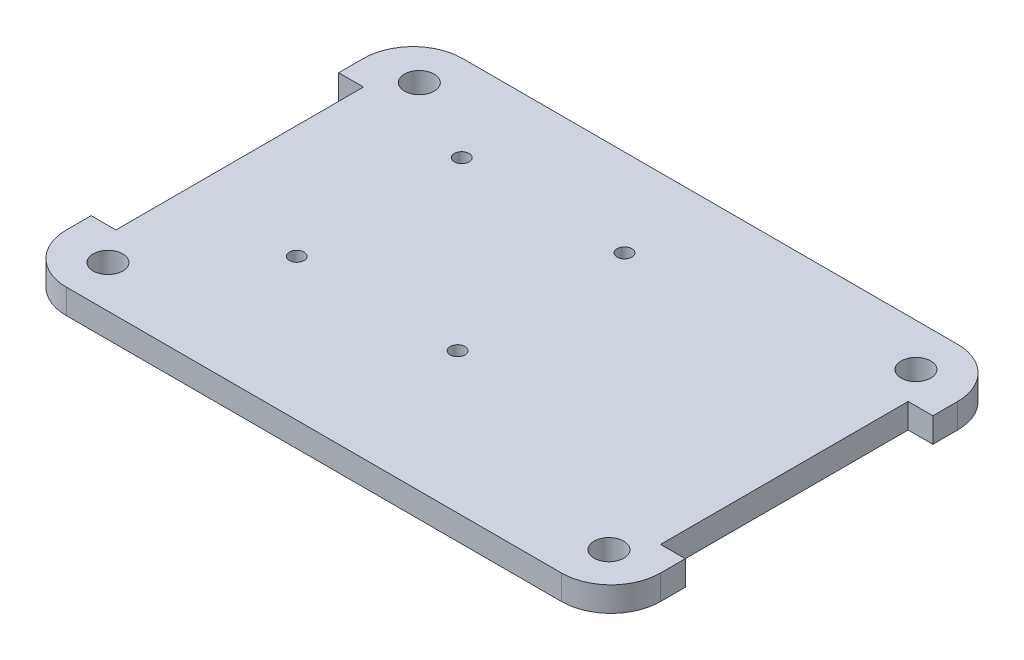
ISO-10303-21;
HEADER;
FILE_DESCRIPTION(('STEP AP214'),'2;1');
FILE_NAME('part.step','',(''),(''),'','','');
FILE_SCHEMA(('AUTOMOTIVE_DESIGN { 1 0 10303 214 1 1 1 1 }'));
ENDSEC;
DATA;
#1=APPLICATION_CONTEXT('core data for automotive mechanical design processes');
#2=APPLICATION_PROTOCOL_DEFINITION('international standard','automotive_design',2000,#1);
#3=PRODUCT_CONTEXT('',#1,'mechanical');
#4=PRODUCT('Part','Part','',(#3));
#5=PRODUCT_RELATED_PRODUCT_CATEGORY('part','',(#4));
#6=PRODUCT_DEFINITION_FORMATION('','',#4);
#7=PRODUCT_DEFINITION_CONTEXT('part definition',#1,'design');
#8=PRODUCT_DEFINITION('design','',#6,#7);
#9=PRODUCT_DEFINITION_SHAPE('','',#8);
#10=(LENGTH_UNIT() NAMED_UNIT(*) SI_UNIT(.MILLI.,.METRE.));
#11=(NAMED_UNIT(*) PLANE_ANGLE_UNIT() SI_UNIT($,.RADIAN.));
#12=(NAMED_UNIT(*) SI_UNIT($,.STERADIAN.) SOLID_ANGLE_UNIT());
#13=UNCERTAINTY_MEASURE_WITH_UNIT(LENGTH_MEASURE(1.E-05),#10,'distance_accuracy_value','');
#14=(GEOMETRIC_REPRESENTATION_CONTEXT(3) GLOBAL_UNCERTAINTY_ASSIGNED_CONTEXT((#13)) GLOBAL_UNIT_ASSIGNED_CONTEXT((#10,
#11,#12)) REPRESENTATION_CONTEXT('',''));
#15=CARTESIAN_POINT('',(0.,0.,0.));
#16=DIRECTION('',(0.,0.,1.));
#17=DIRECTION('',(1.,0.,0.));
#18=AXIS2_PLACEMENT_3D('',#15,#16,#17);
#19=CARTESIAN_POINT('',(115.,5.,15.));
#20=DIRECTION('',(1.,0.,0.));
#21=DIRECTION('',(0.,0.,-1.));
#22=AXIS2_PLACEMENT_3D('',#19,#20,#21);
#23=PLANE('',#22);
#24=DIRECTION('',(0.,0.,1.));
#25=VECTOR('',#24,1.);
#26=CARTESIAN_POINT('',(115.,0.,15.));
#27=LINE('',#26,#25);
#28=CARTESIAN_POINT('',(115.,0.,15.));
#29=VERTEX_POINT('',#28);
#30=CARTESIAN_POINT('',(115.,0.,65.));
#31=VERTEX_POINT('',#30);
#32=EDGE_CURVE('E246',#29,#31,#27,.T.);
#33=ORIENTED_EDGE('',*,*,#32,.F.);
#34=DIRECTION('',(0.,-1.,0.));
#35=VECTOR('',#34,1.);
#36=CARTESIAN_POINT('',(115.,5.,15.));
#37=LINE('',#36,#35);
#38=CARTESIAN_POINT('',(115.,5.,15.));
#39=VERTEX_POINT('',#38);
#40=EDGE_CURVE('E12',#39,#29,#37,.T.);
#41=ORIENTED_EDGE('',*,*,#40,.F.);
#42=DIRECTION('',(0.,0.,1.));
#43=VECTOR('',#42,1.);
#44=CARTESIAN_POINT('',(115.,5.,15.));
#45=LINE('',#44,#43);
#46=CARTESIAN_POINT('',(115.,5.,65.));
#47=VERTEX_POINT('',#46);
#48=EDGE_CURVE('E234',#39,#47,#45,.T.);
#49=ORIENTED_EDGE('',*,*,#48,.T.);
#50=DIRECTION('',(0.,-1.,0.));
#51=VECTOR('',#50,1.);
#52=CARTESIAN_POINT('',(115.,5.,65.));
#53=LINE('',#52,#51);
#54=EDGE_CURVE('E44',#47,#31,#53,.T.);
#55=ORIENTED_EDGE('',*,*,#54,.T.);
#56=EDGE_LOOP('',(#33,#41,#49,#55));
#57=FACE_BOUND('',#56,.T.);
#58=ADVANCED_FACE('F41',(#57),#23,.T.);
#59=CARTESIAN_POINT('',(120.,5.,15.));
#60=DIRECTION('',(0.,0.,1.));
#61=DIRECTION('',(1.,0.,0.));
#62=AXIS2_PLACEMENT_3D('',#59,#60,#61);
#63=PLANE('',#62);
#64=DIRECTION('',(-1.,0.,0.));
#65=VECTOR('',#64,1.);
#66=CARTESIAN_POINT('',(120.,0.,15.));
#67=LINE('',#66,#65);
#68=CARTESIAN_POINT('',(120.,0.,15.));
#69=VERTEX_POINT('',#68);
#70=EDGE_CURVE('E237',#69,#29,#67,.T.);
#71=ORIENTED_EDGE('',*,*,#70,.F.);
#72=DIRECTION('',(0.,-1.,0.));
#73=VECTOR('',#72,1.);
#74=CARTESIAN_POINT('',(120.,5.,15.));
#75=LINE('',#74,#73);
#76=CARTESIAN_POINT('',(120.,5.,15.));
#77=VERTEX_POINT('',#76);
#78=EDGE_CURVE('E50',#77,#69,#75,.T.);
#79=ORIENTED_EDGE('',*,*,#78,.F.);
#80=DIRECTION('',(-1.,0.,0.));
#81=VECTOR('',#80,1.);
#82=CARTESIAN_POINT('',(120.,5.,15.));
#83=LINE('',#82,#81);
#84=EDGE_CURVE('E176',#77,#39,#83,.T.);
#85=ORIENTED_EDGE('',*,*,#84,.T.);
#86=ORIENTED_EDGE('',*,*,#40,.T.);
#87=EDGE_LOOP('',(#71,#79,#85,#86));
#88=FACE_BOUND('',#87,.T.);
#89=ADVANCED_FACE('F318',(#88),#63,.T.);
#90=CARTESIAN_POINT('',(120.,5.,10.0000000000001));
#91=DIRECTION('',(1.,0.,0.));
#92=DIRECTION('',(0.,0.,-1.));
#93=AXIS2_PLACEMENT_3D('',#90,#91,#92);
#94=PLANE('',#93);
#95=DIRECTION('',(0.,0.,1.));
#96=VECTOR('',#95,1.);
#97=CARTESIAN_POINT('',(120.,0.,10.0000000000001));
#98=LINE('',#97,#96);
#99=CARTESIAN_POINT('',(120.,0.,10.0000000000001));
#100=VERTEX_POINT('',#99);
#101=EDGE_CURVE('E163',#100,#69,#98,.T.);
#102=ORIENTED_EDGE('',*,*,#101,.F.);
#103=DIRECTION('',(0.,-1.,0.));
#104=VECTOR('',#103,1.);
#105=CARTESIAN_POINT('',(120.,5.,10.0000000000001));
#106=LINE('',#105,#104);
#107=CARTESIAN_POINT('',(120.,5.,10.0000000000001));
#108=VERTEX_POINT('',#107);
#109=EDGE_CURVE('E158',#108,#100,#106,.T.);
#110=ORIENTED_EDGE('',*,*,#109,.F.);
#111=DIRECTION('',(0.,0.,1.));
#112=VECTOR('',#111,1.);
#113=CARTESIAN_POINT('',(120.,5.,10.0000000000001));
#114=LINE('',#113,#112);
#115=EDGE_CURVE('E161',#108,#77,#114,.T.);
#116=ORIENTED_EDGE('',*,*,#115,.T.);
#117=ORIENTED_EDGE('',*,*,#78,.T.);
#118=EDGE_LOOP('',(#102,#110,#116,#117));
#119=FACE_BOUND('',#118,.T.);
#120=ADVANCED_FACE('F160',(#119),#94,.T.);
#121=CARTESIAN_POINT('',(110.,5.,10.));
#122=DIRECTION('',(0.,-1.,0.));
#123=DIRECTION('',(0.,0.,-1.));
#124=AXIS2_PLACEMENT_3D('',#121,#122,#123);
#125=CYLINDRICAL_SURFACE('',#124,10.);
#126=CARTESIAN_POINT('',(110.,0.,10.));
#127=DIRECTION('',(0.,-1.,0.));
#128=DIRECTION('',(0.,0.,-1.));
#129=AXIS2_PLACEMENT_3D('',#126,#127,#128);
#130=CIRCLE('',#129,10.);
#131=CARTESIAN_POINT('',(110.,0.,0.));
#132=VERTEX_POINT('',#131);
#133=EDGE_CURVE('E281',#132,#100,#130,.T.);
#134=ORIENTED_EDGE('',*,*,#133,.F.);
#135=DIRECTION('',(0.,-1.,0.));
#136=VECTOR('',#135,1.);
#137=CARTESIAN_POINT('',(110.,5.,0.));
#138=LINE('',#137,#136);
#139=CARTESIAN_POINT('',(110.,5.,0.));
#140=VERTEX_POINT('',#139);
#141=EDGE_CURVE('E168',#140,#132,#138,.T.);
#142=ORIENTED_EDGE('',*,*,#141,.F.);
#143=CARTESIAN_POINT('',(110.,5.,10.));
#144=DIRECTION('',(0.,-1.,0.));
#145=DIRECTION('',(0.,0.,-1.));
#146=AXIS2_PLACEMENT_3D('',#143,#144,#145);
#147=CIRCLE('',#146,10.);
#148=EDGE_CURVE('E174',#140,#108,#147,.T.);
#149=ORIENTED_EDGE('',*,*,#148,.T.);
#150=ORIENTED_EDGE('',*,*,#109,.T.);
#151=EDGE_LOOP('',(#134,#142,#149,#150));
#152=FACE_BOUND('',#151,.T.);
#153=ADVANCED_FACE('F178',(#152),#125,.T.);
#154=CARTESIAN_POINT('',(10.0000000000001,5.,0.));
#155=DIRECTION('',(0.,0.,-1.));
#156=DIRECTION('',(-1.,0.,0.));
#157=AXIS2_PLACEMENT_3D('',#154,#155,#156);
#158=PLANE('',#157);
#159=DIRECTION('',(1.,0.,0.));
#160=VECTOR('',#159,1.);
#161=CARTESIAN_POINT('',(10.0000000000001,0.,0.));
#162=LINE('',#161,#160);
#163=CARTESIAN_POINT('',(10.0000000000001,0.,0.));
#164=VERTEX_POINT('',#163);
#165=EDGE_CURVE('E278',#164,#132,#162,.T.);
#166=ORIENTED_EDGE('',*,*,#165,.F.);
#167=DIRECTION('',(0.,-1.,0.));
#168=VECTOR('',#167,1.);
#169=CARTESIAN_POINT('',(10.0000000000001,5.,0.));
#170=LINE('',#169,#168);
#171=CARTESIAN_POINT('',(10.0000000000001,5.,0.));
#172=VERTEX_POINT('',#171);
#173=EDGE_CURVE('E288',#172,#164,#170,.T.);
#174=ORIENTED_EDGE('',*,*,#173,.F.);
#175=DIRECTION('',(1.,0.,0.));
#176=VECTOR('',#175,1.);
#177=CARTESIAN_POINT('',(10.0000000000001,5.,0.));
#178=LINE('',#177,#176);
#179=EDGE_CURVE('E179',#172,#140,#178,.T.);
#180=ORIENTED_EDGE('',*,*,#179,.T.);
#181=ORIENTED_EDGE('',*,*,#141,.T.);
#182=EDGE_LOOP('',(#166,#174,#180,#181));
#183=FACE_BOUND('',#182,.T.);
#184=ADVANCED_FACE('F331',(#183),#158,.T.);
#185=CARTESIAN_POINT('',(10.,5.,10.));
#186=DIRECTION('',(0.,-1.,0.));
#187=DIRECTION('',(0.,0.,-1.));
#188=AXIS2_PLACEMENT_3D('',#185,#186,#187);
#189=CYLINDRICAL_SURFACE('',#188,10.);
#190=CARTESIAN_POINT('',(10.,0.,10.));
#191=DIRECTION('',(0.,1.,0.));
#192=DIRECTION('',(0.,0.,1.));
#193=AXIS2_PLACEMENT_3D('',#190,#191,#192);
#194=CIRCLE('',#193,10.);
#195=CARTESIAN_POINT('',(0.,0.,10.0000000000001));
#196=VERTEX_POINT('',#195);
#197=EDGE_CURVE('E276',#164,#196,#194,.T.);
#198=ORIENTED_EDGE('',*,*,#197,.T.);
#199=DIRECTION('',(0.,-1.,0.));
#200=VECTOR('',#199,1.);
#201=CARTESIAN_POINT('',(0.,5.,10.0000000000001));
#202=LINE('',#201,#200);
#203=CARTESIAN_POINT('',(0.,5.,10.0000000000001));
#204=VERTEX_POINT('',#203);
#205=EDGE_CURVE('E290',#204,#196,#202,.T.);
#206=ORIENTED_EDGE('',*,*,#205,.F.);
#207=CARTESIAN_POINT('',(10.,5.,10.));
#208=DIRECTION('',(0.,1.,0.));
#209=DIRECTION('',(0.,0.,1.));
#210=AXIS2_PLACEMENT_3D('',#207,#208,#209);
#211=CIRCLE('',#210,10.);
#212=EDGE_CURVE('E181',#172,#204,#211,.T.);
#213=ORIENTED_EDGE('',*,*,#212,.F.);
#214=ORIENTED_EDGE('',*,*,#173,.T.);
#215=EDGE_LOOP('',(#198,#206,#213,#214));
#216=FACE_BOUND('',#215,.T.);
#217=ADVANCED_FACE('F334',(#216),#189,.T.);
#218=CARTESIAN_POINT('',(0.,5.,10.0000000000001));
#219=DIRECTION('',(1.,0.,0.));
#220=DIRECTION('',(0.,0.,-1.));
#221=AXIS2_PLACEMENT_3D('',#218,#219,#220);
#222=PLANE('',#221);
#223=DIRECTION('',(0.,0.,1.));
#224=VECTOR('',#223,1.);
#225=CARTESIAN_POINT('',(0.,0.,10.0000000000001));
#226=LINE('',#225,#224);
#227=CARTESIAN_POINT('',(0.,0.,15.));
#228=VERTEX_POINT('',#227);
#229=EDGE_CURVE('E274',#196,#228,#226,.T.);
#230=ORIENTED_EDGE('',*,*,#229,.T.);
#231=DIRECTION('',(0.,-1.,0.));
#232=VECTOR('',#231,1.);
#233=CARTESIAN_POINT('',(0.,5.,15.));
#234=LINE('',#233,#232);
#235=CARTESIAN_POINT('',(0.,5.,15.));
#236=VERTEX_POINT('',#235);
#237=EDGE_CURVE('E293',#236,#228,#234,.T.);
#238=ORIENTED_EDGE('',*,*,#237,.F.);
#239=DIRECTION('',(0.,0.,1.));
#240=VECTOR('',#239,1.);
#241=CARTESIAN_POINT('',(0.,5.,10.0000000000001));
#242=LINE('',#241,#240);
#243=EDGE_CURVE('E197',#204,#236,#242,.T.);
#244=ORIENTED_EDGE('',*,*,#243,.F.);
#245=ORIENTED_EDGE('',*,*,#205,.T.);
#246=EDGE_LOOP('',(#230,#238,#244,#245));
#247=FACE_BOUND('',#246,.T.);
#248=ADVANCED_FACE('F338',(#247),#222,.F.);
#249=CARTESIAN_POINT('',(0.,5.,15.));
#250=DIRECTION('',(0.,0.,-1.));
#251=DIRECTION('',(-1.,0.,0.));
#252=AXIS2_PLACEMENT_3D('',#249,#250,#251);
#253=PLANE('',#252);
#254=DIRECTION('',(1.,0.,0.));
#255=VECTOR('',#254,1.);
#256=CARTESIAN_POINT('',(0.,0.,15.));
#257=LINE('',#256,#255);
#258=CARTESIAN_POINT('',(5.,0.,15.));
#259=VERTEX_POINT('',#258);
#260=EDGE_CURVE('E272',#228,#259,#257,.T.);
#261=ORIENTED_EDGE('',*,*,#260,.T.);
#262=DIRECTION('',(0.,-1.,0.));
#263=VECTOR('',#262,1.);
#264=CARTESIAN_POINT('',(5.,5.,15.));
#265=LINE('',#264,#263);
#266=CARTESIAN_POINT('',(5.,5.,15.));
#267=VERTEX_POINT('',#266);
#268=EDGE_CURVE('E296',#267,#259,#265,.T.);
#269=ORIENTED_EDGE('',*,*,#268,.F.);
#270=DIRECTION('',(1.,0.,0.));
#271=VECTOR('',#270,1.);
#272=CARTESIAN_POINT('',(0.,5.,15.));
#273=LINE('',#272,#271);
#274=EDGE_CURVE('E200',#236,#267,#273,.T.);
#275=ORIENTED_EDGE('',*,*,#274,.F.);
#276=ORIENTED_EDGE('',*,*,#237,.T.);
#277=EDGE_LOOP('',(#261,#269,#275,#276));
#278=FACE_BOUND('',#277,.T.);
#279=ADVANCED_FACE('F342',(#278),#253,.F.);
#280=CARTESIAN_POINT('',(5.,5.,15.));
#281=DIRECTION('',(1.,0.,0.));
#282=DIRECTION('',(0.,0.,-1.));
#283=AXIS2_PLACEMENT_3D('',#280,#281,#282);
#284=PLANE('',#283);
#285=DIRECTION('',(0.,0.,1.));
#286=VECTOR('',#285,1.);
#287=CARTESIAN_POINT('',(5.,0.,15.));
#288=LINE('',#287,#286);
#289=CARTESIAN_POINT('',(5.,0.,65.));
#290=VERTEX_POINT('',#289);
#291=EDGE_CURVE('E270',#259,#290,#288,.T.);
#292=ORIENTED_EDGE('',*,*,#291,.T.);
#293=DIRECTION('',(0.,-1.,0.));
#294=VECTOR('',#293,1.);
#295=CARTESIAN_POINT('',(5.,5.,65.));
#296=LINE('',#295,#294);
#297=CARTESIAN_POINT('',(5.,5.,65.));
#298=VERTEX_POINT('',#297);
#299=EDGE_CURVE('E299',#298,#290,#296,.T.);
#300=ORIENTED_EDGE('',*,*,#299,.F.);
#301=DIRECTION('',(0.,0.,1.));
#302=VECTOR('',#301,1.);
#303=CARTESIAN_POINT('',(5.,5.,15.));
#304=LINE('',#303,#302);
#305=EDGE_CURVE('E203',#267,#298,#304,.T.);
#306=ORIENTED_EDGE('',*,*,#305,.F.);
#307=ORIENTED_EDGE('',*,*,#268,.T.);
#308=EDGE_LOOP('',(#292,#300,#306,#307));
#309=FACE_BOUND('',#308,.T.);
#310=ADVANCED_FACE('F346',(#309),#284,.F.);
#311=CARTESIAN_POINT('',(5.,5.,65.));
#312=DIRECTION('',(0.,0.,1.));
#313=DIRECTION('',(1.,0.,0.));
#314=AXIS2_PLACEMENT_3D('',#311,#312,#313);
#315=PLANE('',#314);
#316=DIRECTION('',(-1.,0.,0.));
#317=VECTOR('',#316,1.);
#318=CARTESIAN_POINT('',(5.,0.,65.));
#319=LINE('',#318,#317);
#320=CARTESIAN_POINT('',(0.,0.,65.));
#321=VERTEX_POINT('',#320);
#322=EDGE_CURVE('E267',#290,#321,#319,.T.);
#323=ORIENTED_EDGE('',*,*,#322,.T.);
#324=DIRECTION('',(0.,-1.,0.));
#325=VECTOR('',#324,1.);
#326=CARTESIAN_POINT('',(0.,5.,65.));
#327=LINE('',#326,#325);
#328=CARTESIAN_POINT('',(0.,5.,65.));
#329=VERTEX_POINT('',#328);
#330=EDGE_CURVE('E302',#329,#321,#327,.T.);
#331=ORIENTED_EDGE('',*,*,#330,.F.);
#332=DIRECTION('',(-1.,0.,0.));
#333=VECTOR('',#332,1.);
#334=CARTESIAN_POINT('',(5.,5.,65.));
#335=LINE('',#334,#333);
#336=EDGE_CURVE('E211',#298,#329,#335,.T.);
#337=ORIENTED_EDGE('',*,*,#336,.F.);
#338=ORIENTED_EDGE('',*,*,#299,.T.);
#339=EDGE_LOOP('',(#323,#331,#337,#338));
#340=FACE_BOUND('',#339,.T.);
#341=ADVANCED_FACE('F350',(#340),#315,.F.);
#342=CARTESIAN_POINT('',(0.,5.,69.9999999999999));
#343=DIRECTION('',(-1.,0.,0.));
#344=DIRECTION('',(0.,0.,1.));
#345=AXIS2_PLACEMENT_3D('',#342,#343,#344);
#346=PLANE('',#345);
#347=DIRECTION('',(0.,0.,-1.));
#348=VECTOR('',#347,1.);
#349=CARTESIAN_POINT('',(0.,0.,69.9999999999999));
#350=LINE('',#349,#348);
#351=CARTESIAN_POINT('',(0.,0.,69.9999999999999));
#352=VERTEX_POINT('',#351);
#353=EDGE_CURVE('E264',#352,#321,#350,.T.);
#354=ORIENTED_EDGE('',*,*,#353,.F.);
#355=DIRECTION('',(0.,-1.,0.));
#356=VECTOR('',#355,1.);
#357=CARTESIAN_POINT('',(0.,5.,69.9999999999999));
#358=LINE('',#357,#356);
#359=CARTESIAN_POINT('',(0.,5.,69.9999999999999));
#360=VERTEX_POINT('',#359);
#361=EDGE_CURVE('E304',#360,#352,#358,.T.);
#362=ORIENTED_EDGE('',*,*,#361,.F.);
#363=DIRECTION('',(0.,0.,-1.));
#364=VECTOR('',#363,1.);
#365=CARTESIAN_POINT('',(0.,5.,69.9999999999999));
#366=LINE('',#365,#364);
#367=EDGE_CURVE('E213',#360,#329,#366,.T.);
#368=ORIENTED_EDGE('',*,*,#367,.T.);
#369=ORIENTED_EDGE('',*,*,#330,.T.);
#370=EDGE_LOOP('',(#354,#362,#368,#369));
#371=FACE_BOUND('',#370,.T.);
#372=ADVANCED_FACE('F354',(#371),#346,.T.);
#373=CARTESIAN_POINT('',(10.,5.,70.));
#374=DIRECTION('',(0.,-1.,0.));
#375=DIRECTION('',(0.,0.,-1.));
#376=AXIS2_PLACEMENT_3D('',#373,#374,#375);
#377=CYLINDRICAL_SURFACE('',#376,10.);
#378=CARTESIAN_POINT('',(10.,0.,70.));
#379=DIRECTION('',(0.,1.,0.));
#380=DIRECTION('',(0.,0.,1.));
#381=AXIS2_PLACEMENT_3D('',#378,#379,#380);
#382=CIRCLE('',#381,10.);
#383=CARTESIAN_POINT('',(10.0000000000001,0.,80.));
#384=VERTEX_POINT('',#383);
#385=EDGE_CURVE('E262',#352,#384,#382,.T.);
#386=ORIENTED_EDGE('',*,*,#385,.T.);
#387=DIRECTION('',(0.,-1.,0.));
#388=VECTOR('',#387,1.);
#389=CARTESIAN_POINT('',(10.0000000000001,5.,80.));
#390=LINE('',#389,#388);
#391=CARTESIAN_POINT('',(10.0000000000001,5.,80.));
#392=VERTEX_POINT('',#391);
#393=EDGE_CURVE('E306',#392,#384,#390,.T.);
#394=ORIENTED_EDGE('',*,*,#393,.F.);
#395=CARTESIAN_POINT('',(10.,5.,70.));
#396=DIRECTION('',(0.,1.,0.));
#397=DIRECTION('',(0.,0.,1.));
#398=AXIS2_PLACEMENT_3D('',#395,#396,#397);
#399=CIRCLE('',#398,10.);
#400=EDGE_CURVE('E217',#360,#392,#399,.T.);
#401=ORIENTED_EDGE('',*,*,#400,.F.);
#402=ORIENTED_EDGE('',*,*,#361,.T.);
#403=EDGE_LOOP('',(#386,#394,#401,#402));
#404=FACE_BOUND('',#403,.T.);
#405=ADVANCED_FACE('F358',(#404),#377,.T.);
#406=CARTESIAN_POINT('',(10.0000000000001,5.,80.));
#407=DIRECTION('',(0.,0.,-1.));
#408=DIRECTION('',(-1.,0.,0.));
#409=AXIS2_PLACEMENT_3D('',#406,#407,#408);
#410=PLANE('',#409);
#411=DIRECTION('',(1.,0.,0.));
#412=VECTOR('',#411,1.);
#413=CARTESIAN_POINT('',(10.0000000000001,0.,80.));
#414=LINE('',#413,#412);
#415=CARTESIAN_POINT('',(110.,0.,80.));
#416=VERTEX_POINT('',#415);
#417=EDGE_CURVE('E259',#384,#416,#414,.T.);
#418=ORIENTED_EDGE('',*,*,#417,.T.);
#419=DIRECTION('',(0.,-1.,0.));
#420=VECTOR('',#419,1.);
#421=CARTESIAN_POINT('',(110.,5.,80.));
#422=LINE('',#421,#420);
#423=CARTESIAN_POINT('',(110.,5.,80.));
#424=VERTEX_POINT('',#423);
#425=EDGE_CURVE('E309',#424,#416,#422,.T.);
#426=ORIENTED_EDGE('',*,*,#425,.F.);
#427=DIRECTION('',(1.,0.,0.));
#428=VECTOR('',#427,1.);
#429=CARTESIAN_POINT('',(10.0000000000001,5.,80.));
#430=LINE('',#429,#428);
#431=EDGE_CURVE('E220',#392,#424,#430,.T.);
#432=ORIENTED_EDGE('',*,*,#431,.F.);
#433=ORIENTED_EDGE('',*,*,#393,.T.);
#434=EDGE_LOOP('',(#418,#426,#432,#433));
#435=FACE_BOUND('',#434,.T.);
#436=ADVANCED_FACE('F362',(#435),#410,.F.);
#437=CARTESIAN_POINT('',(110.,5.,70.));
#438=DIRECTION('',(0.,-1.,0.));
#439=DIRECTION('',(0.,0.,-1.));
#440=AXIS2_PLACEMENT_3D('',#437,#438,#439);
#441=CYLINDRICAL_SURFACE('',#440,9.99999999999999);
#442=CARTESIAN_POINT('',(110.,0.,70.));
#443=DIRECTION('',(0.,-1.,0.));
#444=DIRECTION('',(0.,0.,-1.));
#445=AXIS2_PLACEMENT_3D('',#442,#443,#444);
#446=CIRCLE('',#445,9.99999999999999);
#447=CARTESIAN_POINT('',(120.,0.,69.9999999999999));
#448=VERTEX_POINT('',#447);
#449=EDGE_CURVE('E256',#448,#416,#446,.T.);
#450=ORIENTED_EDGE('',*,*,#449,.F.);
#451=DIRECTION('',(0.,-1.,0.));
#452=VECTOR('',#451,1.);
#453=CARTESIAN_POINT('',(120.,5.,69.9999999999999));
#454=LINE('',#453,#452);
#455=CARTESIAN_POINT('',(120.,5.,69.9999999999999));
#456=VERTEX_POINT('',#455);
#457=EDGE_CURVE('E311',#456,#448,#454,.T.);
#458=ORIENTED_EDGE('',*,*,#457,.F.);
#459=CARTESIAN_POINT('',(110.,5.,70.));
#460=DIRECTION('',(0.,-1.,0.));
#461=DIRECTION('',(0.,0.,-1.));
#462=AXIS2_PLACEMENT_3D('',#459,#460,#461);
#463=CIRCLE('',#462,9.99999999999999);
#464=EDGE_CURVE('E226',#456,#424,#463,.T.);
#465=ORIENTED_EDGE('',*,*,#464,.T.);
#466=ORIENTED_EDGE('',*,*,#425,.T.);
#467=EDGE_LOOP('',(#450,#458,#465,#466));
#468=FACE_BOUND('',#467,.T.);
#469=ADVANCED_FACE('F366',(#468),#441,.T.);
#470=CARTESIAN_POINT('',(120.,5.,69.9999999999999));
#471=DIRECTION('',(-1.,0.,0.));
#472=DIRECTION('',(0.,0.,1.));
#473=AXIS2_PLACEMENT_3D('',#470,#471,#472);
#474=PLANE('',#473);
#475=DIRECTION('',(0.,0.,-1.));
#476=VECTOR('',#475,1.);
#477=CARTESIAN_POINT('',(120.,0.,69.9999999999999));
#478=LINE('',#477,#476);
#479=CARTESIAN_POINT('',(120.,0.,65.));
#480=VERTEX_POINT('',#479);
#481=EDGE_CURVE('E253',#448,#480,#478,.T.);
#482=ORIENTED_EDGE('',*,*,#481,.T.);
#483=DIRECTION('',(0.,-1.,0.));
#484=VECTOR('',#483,1.);
#485=CARTESIAN_POINT('',(120.,5.,65.));
#486=LINE('',#485,#484);
#487=CARTESIAN_POINT('',(120.,5.,65.));
#488=VERTEX_POINT('',#487);
#489=EDGE_CURVE('E312',#488,#480,#486,.T.);
#490=ORIENTED_EDGE('',*,*,#489,.F.);
#491=DIRECTION('',(0.,0.,-1.));
#492=VECTOR('',#491,1.);
#493=CARTESIAN_POINT('',(120.,5.,69.9999999999999));
#494=LINE('',#493,#492);
#495=EDGE_CURVE('E229',#456,#488,#494,.T.);
#496=ORIENTED_EDGE('',*,*,#495,.F.);
#497=ORIENTED_EDGE('',*,*,#457,.T.);
#498=EDGE_LOOP('',(#482,#490,#496,#497));
#499=FACE_BOUND('',#498,.T.);
#500=ADVANCED_FACE('F370',(#499),#474,.F.);
#501=CARTESIAN_POINT('',(115.,5.,65.));
#502=DIRECTION('',(0.,0.,-1.));
#503=DIRECTION('',(-1.,0.,0.));
#504=AXIS2_PLACEMENT_3D('',#501,#502,#503);
#505=PLANE('',#504);
#506=DIRECTION('',(1.,0.,0.));
#507=VECTOR('',#506,1.);
#508=CARTESIAN_POINT('',(115.,0.,65.));
#509=LINE('',#508,#507);
#510=EDGE_CURVE('E249',#31,#480,#509,.T.);
#511=ORIENTED_EDGE('',*,*,#510,.F.);
#512=ORIENTED_EDGE('',*,*,#54,.F.);
#513=DIRECTION('',(1.,0.,0.));
#514=VECTOR('',#513,1.);
#515=CARTESIAN_POINT('',(115.,5.,65.));
#516=LINE('',#515,#514);
#517=EDGE_CURVE('E231',#47,#488,#516,.T.);
#518=ORIENTED_EDGE('',*,*,#517,.T.);
#519=ORIENTED_EDGE('',*,*,#489,.T.);
#520=EDGE_LOOP('',(#511,#512,#518,#519));
#521=FACE_BOUND('',#520,.T.);
#522=ADVANCED_FACE('F314',(#521),#505,.T.);
#523=CARTESIAN_POINT('',(110.,5.,70.));
#524=DIRECTION('',(0.,-1.,0.));
#525=DIRECTION('',(0.,0.,-1.));
#526=AXIS2_PLACEMENT_3D('',#523,#524,#525);
#527=PLANE('',#526);
#528=CARTESIAN_POINT('',(60.3711616840201,5.,17.6601034736963));
#529=DIRECTION('',(0.,1.,0.));
#530=DIRECTION('',(0.,0.,1.));
#531=AXIS2_PLACEMENT_3D('',#528,#529,#530);
#532=CIRCLE('',#531,1.48954634627796);
#533=CARTESIAN_POINT('',(60.3711616840201,5.,19.1496498199742));
#534=VERTEX_POINT('',#533);
#535=EDGE_CURVE('E450',#534,#534,#532,.T.);
#536=ORIENTED_EDGE('',*,*,#535,.F.);
#537=EDGE_LOOP('',(#536));
#538=FACE_BOUND('',#537,.T.);
#539=CARTESIAN_POINT('',(27.8723884469515,5.,51.3436882873075));
#540=DIRECTION('',(0.,1.,0.));
#541=DIRECTION('',(0.,0.,1.));
#542=AXIS2_PLACEMENT_3D('',#539,#540,#541);
#543=CIRCLE('',#542,1.48938933088099);
#544=CARTESIAN_POINT('',(27.8723884469515,5.,52.8330776181885));
#545=VERTEX_POINT('',#544);
#546=EDGE_CURVE('E430',#545,#545,#543,.T.);
#547=ORIENTED_EDGE('',*,*,#546,.F.);
#548=EDGE_LOOP('',(#547));
#549=FACE_BOUND('',#548,.T.);
#550=CARTESIAN_POINT('',(60.628260138326,5.,51.620538184626));
#551=DIRECTION('',(0.,1.,0.));
#552=DIRECTION('',(0.,0.,1.));
#553=AXIS2_PLACEMENT_3D('',#550,#551,#552);
#554=CIRCLE('',#553,1.4891926825019);
#555=CARTESIAN_POINT('',(60.628260138326,5.,53.1097308671279));
#556=VERTEX_POINT('',#555);
#557=EDGE_CURVE('E425',#556,#556,#554,.T.);
#558=ORIENTED_EDGE('',*,*,#557,.F.);
#559=EDGE_LOOP('',(#558));
#560=FACE_BOUND('',#559,.T.);
#561=CARTESIAN_POINT('',(27.2786684341819,5.,17.4388304432651));
#562=DIRECTION('',(0.,1.,0.));
#563=DIRECTION('',(0.,0.,1.));
#564=AXIS2_PLACEMENT_3D('',#561,#562,#563);
#565=CIRCLE('',#564,1.48870682657408);
#566=CARTESIAN_POINT('',(27.2786684341819,5.,18.9275372698392));
#567=VERTEX_POINT('',#566);
#568=EDGE_CURVE('E444',#567,#567,#565,.T.);
#569=ORIENTED_EDGE('',*,*,#568,.F.);
#570=EDGE_LOOP('',(#569));
#571=FACE_BOUND('',#570,.T.);
#572=CARTESIAN_POINT('',(110.199519212436,5.,8.6257796166968));
#573=DIRECTION('',(0.,1.,0.));
#574=DIRECTION('',(0.,0.,1.));
#575=AXIS2_PLACEMENT_3D('',#572,#573,#574);
#576=CIRCLE('',#575,2.9985275585348);
#577=CARTESIAN_POINT('',(110.199519212436,5.,11.6243071752316));
#578=VERTEX_POINT('',#577);
#579=EDGE_CURVE('E463',#578,#578,#576,.T.);
#580=ORIENTED_EDGE('',*,*,#579,.F.);
#581=EDGE_LOOP('',(#580));
#582=FACE_BOUND('',#581,.T.);
#583=CARTESIAN_POINT('',(9.87140556854913,5.,8.58955783006273));
#584=DIRECTION('',(0.,1.,0.));
#585=DIRECTION('',(0.,0.,1.));
#586=AXIS2_PLACEMENT_3D('',#583,#584,#585);
#587=CIRCLE('',#586,3.);
#588=CARTESIAN_POINT('',(9.87140556854913,5.,11.5895578300627));
#589=VERTEX_POINT('',#588);
#590=EDGE_CURVE('E457',#589,#589,#587,.T.);
#591=ORIENTED_EDGE('',*,*,#590,.F.);
#592=EDGE_LOOP('',(#591));
#593=FACE_BOUND('',#592,.T.);
#594=CARTESIAN_POINT('',(9.87978838977159,5.,71.4816092925579));
#595=DIRECTION('',(0.,1.,0.));
#596=DIRECTION('',(0.,0.,1.));
#597=AXIS2_PLACEMENT_3D('',#594,#595,#596);
#598=CIRCLE('',#597,3.00200136369467);
#599=CARTESIAN_POINT('',(9.87978838977159,5.,74.4836106562526));
#600=VERTEX_POINT('',#599);
#601=EDGE_CURVE('E451',#600,#600,#598,.T.);
#602=ORIENTED_EDGE('',*,*,#601,.F.);
#603=EDGE_LOOP('',(#602));
#604=FACE_BOUND('',#603,.T.);
#605=CARTESIAN_POINT('',(110.711521692296,5.,71.1312230359988));
#606=DIRECTION('',(0.,1.,0.));
#607=DIRECTION('',(0.,0.,1.));
#608=AXIS2_PLACEMENT_3D('',#605,#606,#607);
#609=CIRCLE('',#608,2.99992566686079);
#610=CARTESIAN_POINT('',(110.711521692296,5.,74.1311487028596));
#611=VERTEX_POINT('',#610);
#612=EDGE_CURVE('E238',#611,#611,#609,.T.);
#613=ORIENTED_EDGE('',*,*,#612,.F.);
#614=EDGE_LOOP('',(#613));
#615=FACE_BOUND('',#614,.T.);
#616=ORIENTED_EDGE('',*,*,#48,.F.);
#617=ORIENTED_EDGE('',*,*,#84,.F.);
#618=ORIENTED_EDGE('',*,*,#115,.F.);
#619=ORIENTED_EDGE('',*,*,#148,.F.);
#620=ORIENTED_EDGE('',*,*,#179,.F.);
#621=ORIENTED_EDGE('',*,*,#212,.T.);
#622=ORIENTED_EDGE('',*,*,#243,.T.);
#623=ORIENTED_EDGE('',*,*,#274,.T.);
#624=ORIENTED_EDGE('',*,*,#305,.T.);
#625=ORIENTED_EDGE('',*,*,#336,.T.);
#626=ORIENTED_EDGE('',*,*,#367,.F.);
#627=ORIENTED_EDGE('',*,*,#400,.T.);
#628=ORIENTED_EDGE('',*,*,#431,.T.);
#629=ORIENTED_EDGE('',*,*,#464,.F.);
#630=ORIENTED_EDGE('',*,*,#495,.T.);
#631=ORIENTED_EDGE('',*,*,#517,.F.);
#632=EDGE_LOOP('',(#616,#617,#618,#619,#620,#621,#622,#623,#624,#625,#626,#627,#628,#629,#630,#631));
#633=FACE_BOUND('',#632,.T.);
#634=ADVANCED_FACE('F172',(#538,#549,#560,#571,#582,#593,#604,#615,#633),#527,.F.);
#635=CARTESIAN_POINT('',(110.,0.,70.));
#636=DIRECTION('',(0.,-1.,0.));
#637=DIRECTION('',(0.,0.,-1.));
#638=AXIS2_PLACEMENT_3D('',#635,#636,#637);
#639=PLANE('',#638);
#640=CARTESIAN_POINT('',(60.3711616840201,0.,17.6601034736963));
#641=DIRECTION('',(0.,1.,0.));
#642=DIRECTION('',(0.,0.,1.));
#643=AXIS2_PLACEMENT_3D('',#640,#641,#642);
#644=CIRCLE('',#643,1.48954634627796);
#645=CARTESIAN_POINT('',(60.3711616840201,0.,19.1496498199742));
#646=VERTEX_POINT('',#645);
#647=EDGE_CURVE('E501',#646,#646,#644,.T.);
#648=ORIENTED_EDGE('',*,*,#647,.T.);
#649=EDGE_LOOP('',(#648));
#650=FACE_BOUND('',#649,.T.);
#651=CARTESIAN_POINT('',(27.8723884469515,0.,51.3436882873075));
#652=DIRECTION('',(0.,1.,0.));
#653=DIRECTION('',(0.,0.,1.));
#654=AXIS2_PLACEMENT_3D('',#651,#652,#653);
#655=CIRCLE('',#654,1.48938933088099);
#656=CARTESIAN_POINT('',(27.8723884469515,0.,52.8330776181885));
#657=VERTEX_POINT('',#656);
#658=EDGE_CURVE('E427',#657,#657,#655,.T.);
#659=ORIENTED_EDGE('',*,*,#658,.T.);
#660=EDGE_LOOP('',(#659));
#661=FACE_BOUND('',#660,.T.);
#662=CARTESIAN_POINT('',(60.628260138326,0.,51.620538184626));
#663=DIRECTION('',(0.,1.,0.));
#664=DIRECTION('',(0.,0.,1.));
#665=AXIS2_PLACEMENT_3D('',#662,#663,#664);
#666=CIRCLE('',#665,1.4891926825019);
#667=CARTESIAN_POINT('',(60.628260138326,0.,53.1097308671279));
#668=VERTEX_POINT('',#667);
#669=EDGE_CURVE('E422',#668,#668,#666,.T.);
#670=ORIENTED_EDGE('',*,*,#669,.T.);
#671=EDGE_LOOP('',(#670));
#672=FACE_BOUND('',#671,.T.);
#673=CARTESIAN_POINT('',(27.2786684341819,0.,17.4388304432651));
#674=DIRECTION('',(0.,1.,0.));
#675=DIRECTION('',(0.,0.,1.));
#676=AXIS2_PLACEMENT_3D('',#673,#674,#675);
#677=CIRCLE('',#676,1.48870682657408);
#678=CARTESIAN_POINT('',(27.2786684341819,0.,18.9275372698392));
#679=VERTEX_POINT('',#678);
#680=EDGE_CURVE('E449',#679,#679,#677,.T.);
#681=ORIENTED_EDGE('',*,*,#680,.T.);
#682=EDGE_LOOP('',(#681));
#683=FACE_BOUND('',#682,.T.);
#684=CARTESIAN_POINT('',(110.199519212436,0.,8.6257796166968));
#685=DIRECTION('',(0.,1.,0.));
#686=DIRECTION('',(0.,0.,1.));
#687=AXIS2_PLACEMENT_3D('',#684,#685,#686);
#688=CIRCLE('',#687,2.9985275585348);
#689=CARTESIAN_POINT('',(110.199519212436,0.,11.6243071752316));
#690=VERTEX_POINT('',#689);
#691=EDGE_CURVE('E467',#690,#690,#688,.T.);
#692=ORIENTED_EDGE('',*,*,#691,.T.);
#693=EDGE_LOOP('',(#692));
#694=FACE_BOUND('',#693,.T.);
#695=CARTESIAN_POINT('',(9.87140556854913,0.,8.58955783006273));
#696=DIRECTION('',(0.,1.,0.));
#697=DIRECTION('',(0.,0.,1.));
#698=AXIS2_PLACEMENT_3D('',#695,#696,#697);
#699=CIRCLE('',#698,3.);
#700=CARTESIAN_POINT('',(9.87140556854913,0.,11.5895578300627));
#701=VERTEX_POINT('',#700);
#702=EDGE_CURVE('E461',#701,#701,#699,.T.);
#703=ORIENTED_EDGE('',*,*,#702,.T.);
#704=EDGE_LOOP('',(#703));
#705=FACE_BOUND('',#704,.T.);
#706=CARTESIAN_POINT('',(9.87978838977159,0.,71.4816092925579));
#707=DIRECTION('',(0.,1.,0.));
#708=DIRECTION('',(0.,0.,1.));
#709=AXIS2_PLACEMENT_3D('',#706,#707,#708);
#710=CIRCLE('',#709,3.00200136369467);
#711=CARTESIAN_POINT('',(9.87978838977159,0.,74.4836106562526));
#712=VERTEX_POINT('',#711);
#713=EDGE_CURVE('E455',#712,#712,#710,.T.);
#714=ORIENTED_EDGE('',*,*,#713,.T.);
#715=EDGE_LOOP('',(#714));
#716=FACE_BOUND('',#715,.T.);
#717=CARTESIAN_POINT('',(110.711521692296,0.,71.1312230359988));
#718=DIRECTION('',(0.,1.,0.));
#719=DIRECTION('',(0.,0.,1.));
#720=AXIS2_PLACEMENT_3D('',#717,#718,#719);
#721=CIRCLE('',#720,2.99992566686079);
#722=CARTESIAN_POINT('',(110.711521692296,0.,74.1311487028596));
#723=VERTEX_POINT('',#722);
#724=EDGE_CURVE('E250',#723,#723,#721,.T.);
#725=ORIENTED_EDGE('',*,*,#724,.T.);
#726=EDGE_LOOP('',(#725));
#727=FACE_BOUND('',#726,.T.);
#728=ORIENTED_EDGE('',*,*,#32,.T.);
#729=ORIENTED_EDGE('',*,*,#510,.T.);
#730=ORIENTED_EDGE('',*,*,#481,.F.);
#731=ORIENTED_EDGE('',*,*,#449,.T.);
#732=ORIENTED_EDGE('',*,*,#417,.F.);
#733=ORIENTED_EDGE('',*,*,#385,.F.);
#734=ORIENTED_EDGE('',*,*,#353,.T.);
#735=ORIENTED_EDGE('',*,*,#322,.F.);
#736=ORIENTED_EDGE('',*,*,#291,.F.);
#737=ORIENTED_EDGE('',*,*,#260,.F.);
#738=ORIENTED_EDGE('',*,*,#229,.F.);
#739=ORIENTED_EDGE('',*,*,#197,.F.);
#740=ORIENTED_EDGE('',*,*,#165,.T.);
#741=ORIENTED_EDGE('',*,*,#133,.T.);
#742=ORIENTED_EDGE('',*,*,#101,.T.);
#743=ORIENTED_EDGE('',*,*,#70,.T.);
#744=EDGE_LOOP('',(#728,#729,#730,#731,#732,#733,#734,#735,#736,#737,#738,#739,#740,#741,#742,#743));
#745=FACE_BOUND('',#744,.T.);
#746=ADVANCED_FACE('F317',(#650,#661,#672,#683,#694,#705,#716,#727,#745),#639,.T.);
#747=CARTESIAN_POINT('',(110.711521692296,0.,71.1312230359988));
#748=DIRECTION('',(0.,1.,0.));
#749=DIRECTION('',(0.,0.,1.));
#750=AXIS2_PLACEMENT_3D('',#747,#748,#749);
#751=CYLINDRICAL_SURFACE('',#750,2.99992566686079);
#752=ORIENTED_EDGE('',*,*,#724,.F.);
#753=EDGE_LOOP('',(#752));
#754=FACE_BOUND('',#753,.T.);
#755=ORIENTED_EDGE('',*,*,#612,.T.);
#756=EDGE_LOOP('',(#755));
#757=FACE_BOUND('',#756,.T.);
#758=ADVANCED_FACE('F382',(#754,#757),#751,.F.);
#759=CARTESIAN_POINT('',(9.87978838977159,0.,71.4816092925579));
#760=DIRECTION('',(0.,1.,0.));
#761=DIRECTION('',(0.,0.,1.));
#762=AXIS2_PLACEMENT_3D('',#759,#760,#761);
#763=CYLINDRICAL_SURFACE('',#762,3.00200136369467);
#764=ORIENTED_EDGE('',*,*,#713,.F.);
#765=EDGE_LOOP('',(#764));
#766=FACE_BOUND('',#765,.T.);
#767=ORIENTED_EDGE('',*,*,#601,.T.);
#768=EDGE_LOOP('',(#767));
#769=FACE_BOUND('',#768,.T.);
#770=ADVANCED_FACE('F389',(#766,#769),#763,.F.);
#771=CARTESIAN_POINT('',(9.87140556854913,0.,8.58955783006273));
#772=DIRECTION('',(0.,1.,0.));
#773=DIRECTION('',(0.,0.,1.));
#774=AXIS2_PLACEMENT_3D('',#771,#772,#773);
#775=CYLINDRICAL_SURFACE('',#774,3.);
#776=ORIENTED_EDGE('',*,*,#702,.F.);
#777=EDGE_LOOP('',(#776));
#778=FACE_BOUND('',#777,.T.);
#779=ORIENTED_EDGE('',*,*,#590,.T.);
#780=EDGE_LOOP('',(#779));
#781=FACE_BOUND('',#780,.T.);
#782=ADVANCED_FACE('F395',(#778,#781),#775,.F.);
#783=CARTESIAN_POINT('',(110.199519212436,0.,8.6257796166968));
#784=DIRECTION('',(0.,1.,0.));
#785=DIRECTION('',(0.,0.,1.));
#786=AXIS2_PLACEMENT_3D('',#783,#784,#785);
#787=CYLINDRICAL_SURFACE('',#786,2.9985275585348);
#788=ORIENTED_EDGE('',*,*,#691,.F.);
#789=EDGE_LOOP('',(#788));
#790=FACE_BOUND('',#789,.T.);
#791=ORIENTED_EDGE('',*,*,#579,.T.);
#792=EDGE_LOOP('',(#791));
#793=FACE_BOUND('',#792,.T.);
#794=ADVANCED_FACE('F391',(#790,#793),#787,.F.);
#795=CARTESIAN_POINT('',(27.2786684341819,0.,17.4388304432651));
#796=DIRECTION('',(0.,1.,0.));
#797=DIRECTION('',(0.,0.,1.));
#798=AXIS2_PLACEMENT_3D('',#795,#796,#797);
#799=CYLINDRICAL_SURFACE('',#798,1.48870682657408);
#800=ORIENTED_EDGE('',*,*,#680,.F.);
#801=EDGE_LOOP('',(#800));
#802=FACE_BOUND('',#801,.T.);
#803=ORIENTED_EDGE('',*,*,#568,.T.);
#804=EDGE_LOOP('',(#803));
#805=FACE_BOUND('',#804,.T.);
#806=ADVANCED_FACE('F394',(#802,#805),#799,.F.);
#807=CARTESIAN_POINT('',(60.628260138326,0.,51.620538184626));
#808=DIRECTION('',(0.,1.,0.));
#809=DIRECTION('',(0.,0.,1.));
#810=AXIS2_PLACEMENT_3D('',#807,#808,#809);
#811=CYLINDRICAL_SURFACE('',#810,1.4891926825019);
#812=ORIENTED_EDGE('',*,*,#669,.F.);
#813=EDGE_LOOP('',(#812));
#814=FACE_BOUND('',#813,.T.);
#815=ORIENTED_EDGE('',*,*,#557,.T.);
#816=EDGE_LOOP('',(#815));
#817=FACE_BOUND('',#816,.T.);
#818=ADVANCED_FACE('F405',(#814,#817),#811,.F.);
#819=CARTESIAN_POINT('',(27.8723884469515,0.,51.3436882873075));
#820=DIRECTION('',(0.,1.,0.));
#821=DIRECTION('',(0.,0.,1.));
#822=AXIS2_PLACEMENT_3D('',#819,#820,#821);
#823=CYLINDRICAL_SURFACE('',#822,1.48938933088099);
#824=ORIENTED_EDGE('',*,*,#658,.F.);
#825=EDGE_LOOP('',(#824));
#826=FACE_BOUND('',#825,.T.);
#827=ORIENTED_EDGE('',*,*,#546,.T.);
#828=EDGE_LOOP('',(#827));
#829=FACE_BOUND('',#828,.T.);
#830=ADVANCED_FACE('F407',(#826,#829),#823,.F.);
#831=CARTESIAN_POINT('',(60.3711616840201,0.,17.6601034736963));
#832=DIRECTION('',(0.,1.,0.));
#833=DIRECTION('',(0.,0.,1.));
#834=AXIS2_PLACEMENT_3D('',#831,#832,#833);
#835=CYLINDRICAL_SURFACE('',#834,1.48954634627796);
#836=ORIENTED_EDGE('',*,*,#647,.F.);
#837=EDGE_LOOP('',(#836));
#838=FACE_BOUND('',#837,.T.);
#839=ORIENTED_EDGE('',*,*,#535,.T.);
#840=EDGE_LOOP('',(#839));
#841=FACE_BOUND('',#840,.T.);
#842=ADVANCED_FACE('F410',(#838,#841),#835,.F.);
#843=CLOSED_SHELL('',(#58,#89,#120,#153,#184,#217,#248,#279,#310,#341,#372,#405,#436,#469,#500,
#522,#634,#746,#758,#770,#782,#794,#806,#818,#830,#842));
#844=MANIFOLD_SOLID_BREP('B2',#843);
#845=ADVANCED_BREP_SHAPE_REPRESENTATION('',(#18,#844),#14);
#846=SHAPE_DEFINITION_REPRESENTATION(#9,#845);
ENDSEC;
END-ISO-10303-21;
